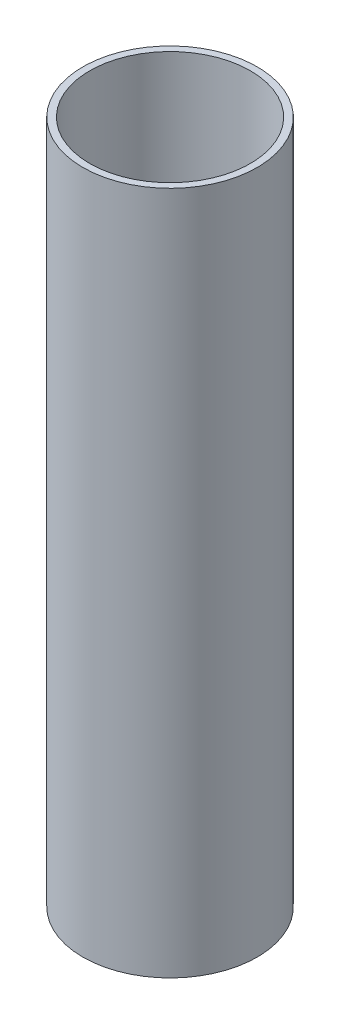
ISO-10303-21;
HEADER;
FILE_DESCRIPTION(('STEP AP214'),'2;1');
FILE_NAME('part.step','',(''),(''),'','','');
FILE_SCHEMA(('AUTOMOTIVE_DESIGN { 1 0 10303 214 1 1 1 1 }'));
ENDSEC;
DATA;
#1=APPLICATION_CONTEXT('core data for automotive mechanical design processes');
#2=APPLICATION_PROTOCOL_DEFINITION('international standard','automotive_design',2000,#1);
#3=PRODUCT_CONTEXT('',#1,'mechanical');
#4=PRODUCT('Part','Part','',(#3));
#5=PRODUCT_RELATED_PRODUCT_CATEGORY('part','',(#4));
#6=PRODUCT_DEFINITION_FORMATION('','',#4);
#7=PRODUCT_DEFINITION_CONTEXT('part definition',#1,'design');
#8=PRODUCT_DEFINITION('design','',#6,#7);
#9=PRODUCT_DEFINITION_SHAPE('','',#8);
#10=(LENGTH_UNIT() NAMED_UNIT(*) SI_UNIT(.MILLI.,.METRE.));
#11=(NAMED_UNIT(*) PLANE_ANGLE_UNIT() SI_UNIT($,.RADIAN.));
#12=(NAMED_UNIT(*) SI_UNIT($,.STERADIAN.) SOLID_ANGLE_UNIT());
#13=UNCERTAINTY_MEASURE_WITH_UNIT(LENGTH_MEASURE(1.E-05),#10,'distance_accuracy_value','');
#14=(GEOMETRIC_REPRESENTATION_CONTEXT(3) GLOBAL_UNCERTAINTY_ASSIGNED_CONTEXT((#13)) GLOBAL_UNIT_ASSIGNED_CONTEXT((#10,
#11,#12)) REPRESENTATION_CONTEXT('',''));
#15=CARTESIAN_POINT('',(0.,0.,0.));
#16=DIRECTION('',(0.,0.,1.));
#17=DIRECTION('',(1.,0.,0.));
#18=AXIS2_PLACEMENT_3D('',#15,#16,#17);
#19=CARTESIAN_POINT('',(0.,200.,0.));
#20=DIRECTION('',(0.,-1.,0.));
#21=DIRECTION('',(0.,0.,-1.));
#22=AXIS2_PLACEMENT_3D('',#19,#20,#21);
#23=CYLINDRICAL_SURFACE('',#22,23.5);
#24=CARTESIAN_POINT('',(0.,200.,0.));
#25=DIRECTION('',(0.,1.,0.));
#26=DIRECTION('',(0.,0.,1.));
#27=AXIS2_PLACEMENT_3D('',#24,#25,#26);
#28=CIRCLE('',#27,23.5);
#29=CARTESIAN_POINT('',(0.,200.,23.5));
#30=VERTEX_POINT('',#29);
#31=EDGE_CURVE('E50',#30,#30,#28,.T.);
#32=ORIENTED_EDGE('',*,*,#31,.T.);
#33=EDGE_LOOP('',(#32));
#34=FACE_BOUND('',#33,.T.);
#35=CARTESIAN_POINT('',(0.,2.,0.));
#36=DIRECTION('',(0.,-1.,0.));
#37=DIRECTION('',(0.,0.,-1.));
#38=AXIS2_PLACEMENT_3D('',#35,#36,#37);
#39=CIRCLE('',#38,23.5);
#40=CARTESIAN_POINT('',(0.,2.,-23.5));
#41=VERTEX_POINT('',#40);
#42=EDGE_CURVE('E54',#41,#41,#39,.T.);
#43=ORIENTED_EDGE('',*,*,#42,.T.);
#44=EDGE_LOOP('',(#43));
#45=FACE_BOUND('',#44,.T.);
#46=ADVANCED_FACE('F39',(#34,#45),#23,.F.);
#47=CARTESIAN_POINT('',(0.,200.,0.));
#48=DIRECTION('',(0.,1.,0.));
#49=DIRECTION('',(0.,0.,1.));
#50=AXIS2_PLACEMENT_3D('',#47,#48,#49);
#51=PLANE('',#50);
#52=CARTESIAN_POINT('',(0.,200.,0.));
#53=DIRECTION('',(0.,1.,0.));
#54=DIRECTION('',(0.,0.,1.));
#55=AXIS2_PLACEMENT_3D('',#52,#53,#54);
#56=CIRCLE('',#55,25.5);
#57=CARTESIAN_POINT('',(0.,200.,25.5));
#58=VERTEX_POINT('',#57);
#59=EDGE_CURVE('E11',#58,#58,#56,.T.);
#60=ORIENTED_EDGE('',*,*,#59,.T.);
#61=EDGE_LOOP('',(#60));
#62=FACE_BOUND('',#61,.T.);
#63=ORIENTED_EDGE('',*,*,#31,.F.);
#64=EDGE_LOOP('',(#63));
#65=FACE_BOUND('',#64,.T.);
#66=ADVANCED_FACE('F68',(#62,#65),#51,.T.);
#67=CARTESIAN_POINT('',(0.,0.,0.));
#68=DIRECTION('',(0.,1.,0.));
#69=DIRECTION('',(0.,0.,1.));
#70=AXIS2_PLACEMENT_3D('',#67,#68,#69);
#71=PLANE('',#70);
#72=CARTESIAN_POINT('',(0.,0.,0.));
#73=DIRECTION('',(0.,1.,0.));
#74=DIRECTION('',(0.,0.,1.));
#75=AXIS2_PLACEMENT_3D('',#72,#73,#74);
#76=CIRCLE('',#75,25.5);
#77=CARTESIAN_POINT('',(0.,0.,25.5));
#78=VERTEX_POINT('',#77);
#79=EDGE_CURVE('E43',#78,#78,#76,.T.);
#80=ORIENTED_EDGE('',*,*,#79,.F.);
#81=EDGE_LOOP('',(#80));
#82=FACE_BOUND('',#81,.T.);
#83=CARTESIAN_POINT('',(0.,0.,0.));
#84=DIRECTION('',(0.,-1.,0.));
#85=DIRECTION('',(0.,0.,-1.));
#86=AXIS2_PLACEMENT_3D('',#83,#84,#85);
#87=CIRCLE('',#86,5.);
#88=CARTESIAN_POINT('',(0.,0.,-5.));
#89=VERTEX_POINT('',#88);
#90=EDGE_CURVE('E60',#89,#89,#87,.T.);
#91=ORIENTED_EDGE('',*,*,#90,.F.);
#92=EDGE_LOOP('',(#91));
#93=FACE_BOUND('',#92,.T.);
#94=ADVANCED_FACE('F66',(#82,#93),#71,.F.);
#95=CARTESIAN_POINT('',(0.,200.,0.));
#96=DIRECTION('',(0.,-1.,0.));
#97=DIRECTION('',(0.,0.,-1.));
#98=AXIS2_PLACEMENT_3D('',#95,#96,#97);
#99=CYLINDRICAL_SURFACE('',#98,25.5);
#100=ORIENTED_EDGE('',*,*,#59,.F.);
#101=EDGE_LOOP('',(#100));
#102=FACE_BOUND('',#101,.T.);
#103=ORIENTED_EDGE('',*,*,#79,.T.);
#104=EDGE_LOOP('',(#103));
#105=FACE_BOUND('',#104,.T.);
#106=ADVANCED_FACE('F41',(#102,#105),#99,.T.);
#107=CARTESIAN_POINT('',(0.,0.,0.));
#108=DIRECTION('',(0.,-1.,0.));
#109=DIRECTION('',(-1.,0.,0.));
#110=AXIS2_PLACEMENT_3D('',#107,#108,#109);
#111=SPHERICAL_SURFACE('',#110,5.);
#112=ORIENTED_EDGE('',*,*,#90,.T.);
#113=EDGE_LOOP('',(#112));
#114=FACE_BOUND('',#113,.T.);
#115=ADVANCED_FACE('F64',(#114),#111,.F.);
#116=CARTESIAN_POINT('',(-6.70820393249937,2.,0.));
#117=DIRECTION('',(0.,-1.,0.));
#118=DIRECTION('',(0.,0.,-1.));
#119=AXIS2_PLACEMENT_3D('',#116,#117,#118);
#120=PLANE('',#119);
#121=ORIENTED_EDGE('',*,*,#42,.F.);
#122=EDGE_LOOP('',(#121));
#123=FACE_BOUND('',#122,.T.);
#124=CARTESIAN_POINT('',(0.,2.,0.));
#125=DIRECTION('',(0.,-1.,0.));
#126=DIRECTION('',(0.,0.,-1.));
#127=AXIS2_PLACEMENT_3D('',#124,#125,#126);
#128=CIRCLE('',#127,6.70820393249937);
#129=CARTESIAN_POINT('',(0.,2.,-6.70820393249937));
#130=VERTEX_POINT('',#129);
#131=EDGE_CURVE('E57',#130,#130,#128,.T.);
#132=ORIENTED_EDGE('',*,*,#131,.T.);
#133=EDGE_LOOP('',(#132));
#134=FACE_BOUND('',#133,.T.);
#135=ADVANCED_FACE('F84',(#123,#134),#120,.F.);
#136=CARTESIAN_POINT('',(0.,0.,0.));
#137=DIRECTION('',(0.,-1.,0.));
#138=DIRECTION('',(-1.,0.,0.));
#139=AXIS2_PLACEMENT_3D('',#136,#137,#138);
#140=SPHERICAL_SURFACE('',#139,7.);
#141=ORIENTED_EDGE('',*,*,#131,.F.);
#142=EDGE_LOOP('',(#141));
#143=FACE_BOUND('',#142,.T.);
#144=ADVANCED_FACE('F87',(#143),#140,.T.);
#145=CLOSED_SHELL('',(#46,#66,#94,#106,#115,#135,#144));
#146=MANIFOLD_SOLID_BREP('B2',#145);
#147=ADVANCED_BREP_SHAPE_REPRESENTATION('',(#18,#146),#14);
#148=SHAPE_DEFINITION_REPRESENTATION(#9,#147);
ENDSEC;
END-ISO-10303-21;
